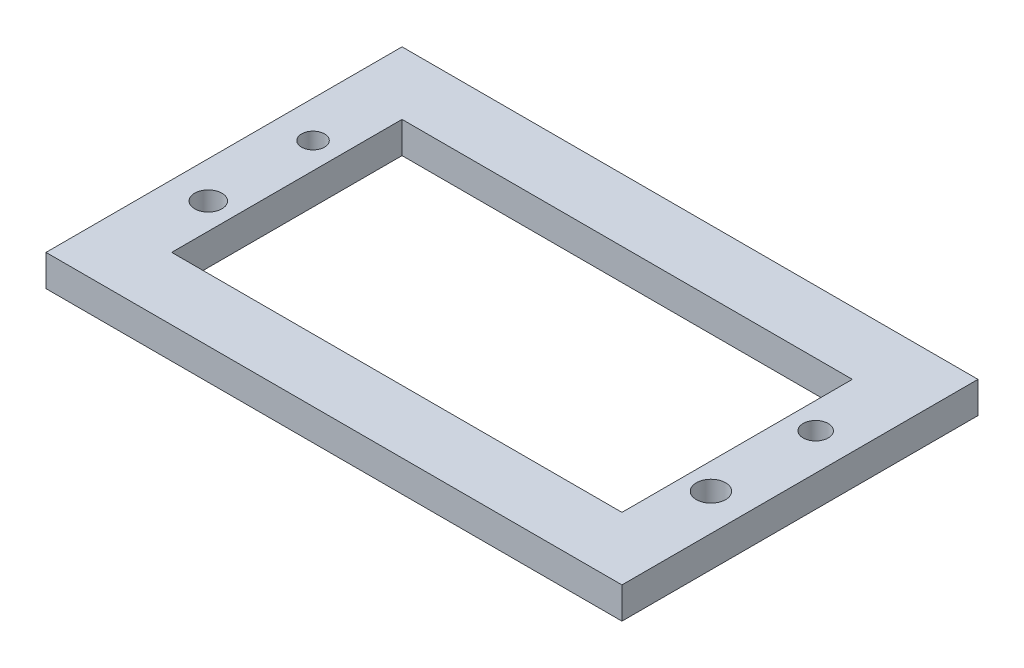
ISO-10303-21;
HEADER;
FILE_DESCRIPTION(('STEP AP214'),'2;1');
FILE_NAME('part.step','',(''),(''),'','','');
FILE_SCHEMA(('AUTOMOTIVE_DESIGN { 1 0 10303 214 1 1 1 1 }'));
ENDSEC;
DATA;
#1=APPLICATION_CONTEXT('core data for automotive mechanical design processes');
#2=APPLICATION_PROTOCOL_DEFINITION('international standard','automotive_design',2000,#1);
#3=PRODUCT_CONTEXT('',#1,'mechanical');
#4=PRODUCT('Part','Part','',(#3));
#5=PRODUCT_RELATED_PRODUCT_CATEGORY('part','',(#4));
#6=PRODUCT_DEFINITION_FORMATION('','',#4);
#7=PRODUCT_DEFINITION_CONTEXT('part definition',#1,'design');
#8=PRODUCT_DEFINITION('design','',#6,#7);
#9=PRODUCT_DEFINITION_SHAPE('','',#8);
#10=(LENGTH_UNIT() NAMED_UNIT(*) SI_UNIT(.MILLI.,.METRE.));
#11=(NAMED_UNIT(*) PLANE_ANGLE_UNIT() SI_UNIT($,.RADIAN.));
#12=(NAMED_UNIT(*) SI_UNIT($,.STERADIAN.) SOLID_ANGLE_UNIT());
#13=UNCERTAINTY_MEASURE_WITH_UNIT(LENGTH_MEASURE(1.E-05),#10,'distance_accuracy_value','');
#14=(GEOMETRIC_REPRESENTATION_CONTEXT(3) GLOBAL_UNCERTAINTY_ASSIGNED_CONTEXT((#13)) GLOBAL_UNIT_ASSIGNED_CONTEXT((#10,
#11,#12)) REPRESENTATION_CONTEXT('',''));
#15=CARTESIAN_POINT('',(0.,0.,0.));
#16=DIRECTION('',(0.,0.,1.));
#17=DIRECTION('',(1.,0.,0.));
#18=AXIS2_PLACEMENT_3D('',#15,#16,#17);
#19=CARTESIAN_POINT('',(0.,3.,0.));
#20=DIRECTION('',(0.,-1.,0.));
#21=DIRECTION('',(0.,0.,-1.));
#22=AXIS2_PLACEMENT_3D('',#19,#20,#21);
#23=PLANE('',#22);
#24=DIRECTION('',(0.,0.,-1.));
#25=VECTOR('',#24,1.);
#26=CARTESIAN_POINT('',(27.5,3.,17.));
#27=LINE('',#26,#25);
#28=CARTESIAN_POINT('',(27.5,3.,17.));
#29=VERTEX_POINT('',#28);
#30=CARTESIAN_POINT('',(27.5,3.,-17.));
#31=VERTEX_POINT('',#30);
#32=EDGE_CURVE('E137',#29,#31,#27,.T.);
#33=ORIENTED_EDGE('',*,*,#32,.T.);
#34=DIRECTION('',(-1.,0.,0.));
#35=VECTOR('',#34,1.);
#36=CARTESIAN_POINT('',(-27.5,3.,-17.));
#37=LINE('',#36,#35);
#38=CARTESIAN_POINT('',(-27.5,3.,-17.));
#39=VERTEX_POINT('',#38);
#40=EDGE_CURVE('E140',#31,#39,#37,.T.);
#41=ORIENTED_EDGE('',*,*,#40,.T.);
#42=DIRECTION('',(0.,0.,1.));
#43=VECTOR('',#42,1.);
#44=CARTESIAN_POINT('',(-27.5,3.,17.));
#45=LINE('',#44,#43);
#46=CARTESIAN_POINT('',(-27.5,3.,17.));
#47=VERTEX_POINT('',#46);
#48=EDGE_CURVE('E143',#39,#47,#45,.T.);
#49=ORIENTED_EDGE('',*,*,#48,.T.);
#50=DIRECTION('',(1.,0.,0.));
#51=VECTOR('',#50,1.);
#52=CARTESIAN_POINT('',(-27.5,3.,17.));
#53=LINE('',#52,#51);
#54=EDGE_CURVE('E145',#47,#29,#53,.T.);
#55=ORIENTED_EDGE('',*,*,#54,.T.);
#56=EDGE_LOOP('',(#33,#41,#49,#55));
#57=FACE_BOUND('',#56,.T.);
#58=DIRECTION('',(0.,0.,1.));
#59=VECTOR('',#58,1.);
#60=CARTESIAN_POINT('',(-21.5,3.,11.));
#61=LINE('',#60,#59);
#62=CARTESIAN_POINT('',(-21.5,3.,-11.));
#63=VERTEX_POINT('',#62);
#64=CARTESIAN_POINT('',(-21.5,3.,11.));
#65=VERTEX_POINT('',#64);
#66=EDGE_CURVE('E98',#63,#65,#61,.T.);
#67=ORIENTED_EDGE('',*,*,#66,.F.);
#68=DIRECTION('',(-1.,0.,0.));
#69=VECTOR('',#68,1.);
#70=CARTESIAN_POINT('',(-21.5,3.,-11.));
#71=LINE('',#70,#69);
#72=CARTESIAN_POINT('',(21.5,3.,-11.));
#73=VERTEX_POINT('',#72);
#74=EDGE_CURVE('E121',#73,#63,#71,.T.);
#75=ORIENTED_EDGE('',*,*,#74,.F.);
#76=DIRECTION('',(0.,0.,-1.));
#77=VECTOR('',#76,1.);
#78=CARTESIAN_POINT('',(21.5,3.,11.));
#79=LINE('',#78,#77);
#80=CARTESIAN_POINT('',(21.5,3.,11.));
#81=VERTEX_POINT('',#80);
#82=EDGE_CURVE('E119',#81,#73,#79,.T.);
#83=ORIENTED_EDGE('',*,*,#82,.F.);
#84=DIRECTION('',(1.,0.,0.));
#85=VECTOR('',#84,1.);
#86=CARTESIAN_POINT('',(-21.5,3.,11.));
#87=LINE('',#86,#85);
#88=EDGE_CURVE('E106',#65,#81,#87,.T.);
#89=ORIENTED_EDGE('',*,*,#88,.F.);
#90=EDGE_LOOP('',(#67,#75,#83,#89));
#91=FACE_BOUND('',#90,.T.);
#92=CARTESIAN_POINT('',(-24.,3.,-5.));
#93=DIRECTION('',(0.,1.,0.));
#94=DIRECTION('',(0.,0.,1.));
#95=AXIS2_PLACEMENT_3D('',#92,#93,#94);
#96=CIRCLE('',#95,1.1);
#97=CARTESIAN_POINT('',(-24.,3.,-3.9));
#98=VERTEX_POINT('',#97);
#99=EDGE_CURVE('E127',#98,#98,#96,.T.);
#100=ORIENTED_EDGE('',*,*,#99,.F.);
#101=EDGE_LOOP('',(#100));
#102=FACE_BOUND('',#101,.T.);
#103=CARTESIAN_POINT('',(-24.,3.,5.));
#104=DIRECTION('',(0.,1.,0.));
#105=DIRECTION('',(0.,0.,1.));
#106=AXIS2_PLACEMENT_3D('',#103,#104,#105);
#107=CIRCLE('',#106,1.3);
#108=CARTESIAN_POINT('',(-24.,3.,6.3));
#109=VERTEX_POINT('',#108);
#110=EDGE_CURVE('E249',#109,#109,#107,.T.);
#111=ORIENTED_EDGE('',*,*,#110,.F.);
#112=EDGE_LOOP('',(#111));
#113=FACE_BOUND('',#112,.T.);
#114=CARTESIAN_POINT('',(24.,3.,-5.));
#115=DIRECTION('',(0.,1.,0.));
#116=DIRECTION('',(0.,0.,1.));
#117=AXIS2_PLACEMENT_3D('',#114,#115,#116);
#118=CIRCLE('',#117,1.2);
#119=CARTESIAN_POINT('',(24.,3.,-3.8));
#120=VERTEX_POINT('',#119);
#121=EDGE_CURVE('E243',#120,#120,#118,.T.);
#122=ORIENTED_EDGE('',*,*,#121,.F.);
#123=EDGE_LOOP('',(#122));
#124=FACE_BOUND('',#123,.T.);
#125=CARTESIAN_POINT('',(24.,3.,5.));
#126=DIRECTION('',(0.,1.,0.));
#127=DIRECTION('',(0.,0.,1.));
#128=AXIS2_PLACEMENT_3D('',#125,#126,#127);
#129=CIRCLE('',#128,1.4);
#130=CARTESIAN_POINT('',(24.,3.,6.4));
#131=VERTEX_POINT('',#130);
#132=EDGE_CURVE('E234',#131,#131,#129,.T.);
#133=ORIENTED_EDGE('',*,*,#132,.F.);
#134=EDGE_LOOP('',(#133));
#135=FACE_BOUND('',#134,.T.);
#136=ADVANCED_FACE('F33',(#57,#91,#102,#113,#124,#135),#23,.F.);
#137=CARTESIAN_POINT('',(0.,0.,0.));
#138=DIRECTION('',(0.,-1.,0.));
#139=DIRECTION('',(0.,0.,-1.));
#140=AXIS2_PLACEMENT_3D('',#137,#138,#139);
#141=PLANE('',#140);
#142=CARTESIAN_POINT('',(24.,0.,-5.));
#143=DIRECTION('',(0.,1.,0.));
#144=DIRECTION('',(0.,0.,1.));
#145=AXIS2_PLACEMENT_3D('',#142,#143,#144);
#146=CIRCLE('',#145,1.2);
#147=CARTESIAN_POINT('',(24.,0.,-3.8));
#148=VERTEX_POINT('',#147);
#149=EDGE_CURVE('E240',#148,#148,#146,.T.);
#150=ORIENTED_EDGE('',*,*,#149,.T.);
#151=EDGE_LOOP('',(#150));
#152=FACE_BOUND('',#151,.T.);
#153=CARTESIAN_POINT('',(-24.,0.,-5.));
#154=DIRECTION('',(0.,1.,0.));
#155=DIRECTION('',(0.,0.,1.));
#156=AXIS2_PLACEMENT_3D('',#153,#154,#155);
#157=CIRCLE('',#156,1.1);
#158=CARTESIAN_POINT('',(-24.,0.,-3.9));
#159=VERTEX_POINT('',#158);
#160=EDGE_CURVE('E252',#159,#159,#157,.T.);
#161=ORIENTED_EDGE('',*,*,#160,.T.);
#162=EDGE_LOOP('',(#161));
#163=FACE_BOUND('',#162,.T.);
#164=DIRECTION('',(0.,0.,-1.));
#165=VECTOR('',#164,1.);
#166=CARTESIAN_POINT('',(27.5,0.,17.));
#167=LINE('',#166,#165);
#168=CARTESIAN_POINT('',(27.5,0.,17.));
#169=VERTEX_POINT('',#168);
#170=CARTESIAN_POINT('',(27.5,0.,-17.));
#171=VERTEX_POINT('',#170);
#172=EDGE_CURVE('E114',#169,#171,#167,.T.);
#173=ORIENTED_EDGE('',*,*,#172,.F.);
#174=DIRECTION('',(1.,0.,0.));
#175=VECTOR('',#174,1.);
#176=CARTESIAN_POINT('',(-27.5,0.,17.));
#177=LINE('',#176,#175);
#178=CARTESIAN_POINT('',(-27.5,0.,17.));
#179=VERTEX_POINT('',#178);
#180=EDGE_CURVE('E141',#179,#169,#177,.T.);
#181=ORIENTED_EDGE('',*,*,#180,.F.);
#182=DIRECTION('',(0.,0.,1.));
#183=VECTOR('',#182,1.);
#184=CARTESIAN_POINT('',(-27.5,0.,17.));
#185=LINE('',#184,#183);
#186=CARTESIAN_POINT('',(-27.5,0.,-17.));
#187=VERTEX_POINT('',#186);
#188=EDGE_CURVE('E152',#187,#179,#185,.T.);
#189=ORIENTED_EDGE('',*,*,#188,.F.);
#190=DIRECTION('',(-1.,0.,0.));
#191=VECTOR('',#190,1.);
#192=CARTESIAN_POINT('',(-27.5,0.,-17.));
#193=LINE('',#192,#191);
#194=EDGE_CURVE('E150',#171,#187,#193,.T.);
#195=ORIENTED_EDGE('',*,*,#194,.F.);
#196=EDGE_LOOP('',(#173,#181,#189,#195));
#197=FACE_BOUND('',#196,.T.);
#198=DIRECTION('',(-1.,0.,0.));
#199=VECTOR('',#198,1.);
#200=CARTESIAN_POINT('',(-21.5,0.,-11.));
#201=LINE('',#200,#199);
#202=CARTESIAN_POINT('',(21.5,0.,-11.));
#203=VERTEX_POINT('',#202);
#204=CARTESIAN_POINT('',(-21.5,0.,-11.));
#205=VERTEX_POINT('',#204);
#206=EDGE_CURVE('E107',#203,#205,#201,.T.);
#207=ORIENTED_EDGE('',*,*,#206,.T.);
#208=DIRECTION('',(0.,0.,1.));
#209=VECTOR('',#208,1.);
#210=CARTESIAN_POINT('',(-21.5,0.,11.));
#211=LINE('',#210,#209);
#212=CARTESIAN_POINT('',(-21.5,0.,11.));
#213=VERTEX_POINT('',#212);
#214=EDGE_CURVE('E56',#205,#213,#211,.T.);
#215=ORIENTED_EDGE('',*,*,#214,.T.);
#216=DIRECTION('',(1.,0.,0.));
#217=VECTOR('',#216,1.);
#218=CARTESIAN_POINT('',(-21.5,0.,11.));
#219=LINE('',#218,#217);
#220=CARTESIAN_POINT('',(21.5,0.,11.));
#221=VERTEX_POINT('',#220);
#222=EDGE_CURVE('E113',#213,#221,#219,.T.);
#223=ORIENTED_EDGE('',*,*,#222,.T.);
#224=DIRECTION('',(0.,0.,-1.));
#225=VECTOR('',#224,1.);
#226=CARTESIAN_POINT('',(21.5,0.,11.));
#227=LINE('',#226,#225);
#228=EDGE_CURVE('E129',#221,#203,#227,.T.);
#229=ORIENTED_EDGE('',*,*,#228,.T.);
#230=EDGE_LOOP('',(#207,#215,#223,#229));
#231=FACE_BOUND('',#230,.T.);
#232=CARTESIAN_POINT('',(-24.,0.,5.));
#233=DIRECTION('',(0.,1.,0.));
#234=DIRECTION('',(0.,0.,1.));
#235=AXIS2_PLACEMENT_3D('',#232,#233,#234);
#236=CIRCLE('',#235,1.3);
#237=CARTESIAN_POINT('',(-24.,0.,6.3));
#238=VERTEX_POINT('',#237);
#239=EDGE_CURVE('E246',#238,#238,#236,.T.);
#240=ORIENTED_EDGE('',*,*,#239,.T.);
#241=EDGE_LOOP('',(#240));
#242=FACE_BOUND('',#241,.T.);
#243=CARTESIAN_POINT('',(24.,0.,5.));
#244=DIRECTION('',(0.,1.,0.));
#245=DIRECTION('',(0.,0.,1.));
#246=AXIS2_PLACEMENT_3D('',#243,#244,#245);
#247=CIRCLE('',#246,1.4);
#248=CARTESIAN_POINT('',(24.,0.,6.4));
#249=VERTEX_POINT('',#248);
#250=EDGE_CURVE('E237',#249,#249,#247,.T.);
#251=ORIENTED_EDGE('',*,*,#250,.T.);
#252=EDGE_LOOP('',(#251));
#253=FACE_BOUND('',#252,.T.);
#254=ADVANCED_FACE('F170',(#152,#163,#197,#231,#242,#253),#141,.T.);
#255=CARTESIAN_POINT('',(27.5,3.,17.));
#256=DIRECTION('',(-1.,0.,0.));
#257=DIRECTION('',(0.,0.,1.));
#258=AXIS2_PLACEMENT_3D('',#255,#256,#257);
#259=PLANE('',#258);
#260=ORIENTED_EDGE('',*,*,#172,.T.);
#261=DIRECTION('',(0.,-1.,0.));
#262=VECTOR('',#261,1.);
#263=CARTESIAN_POINT('',(27.5,3.,-17.));
#264=LINE('',#263,#262);
#265=EDGE_CURVE('E11',#31,#171,#264,.T.);
#266=ORIENTED_EDGE('',*,*,#265,.F.);
#267=ORIENTED_EDGE('',*,*,#32,.F.);
#268=DIRECTION('',(0.,-1.,0.));
#269=VECTOR('',#268,1.);
#270=CARTESIAN_POINT('',(27.5,3.,17.));
#271=LINE('',#270,#269);
#272=EDGE_CURVE('E147',#29,#169,#271,.T.);
#273=ORIENTED_EDGE('',*,*,#272,.T.);
#274=EDGE_LOOP('',(#260,#266,#267,#273));
#275=FACE_BOUND('',#274,.T.);
#276=ADVANCED_FACE('F35',(#275),#259,.F.);
#277=CARTESIAN_POINT('',(-27.5,3.,-17.));
#278=DIRECTION('',(0.,0.,1.));
#279=DIRECTION('',(1.,0.,0.));
#280=AXIS2_PLACEMENT_3D('',#277,#278,#279);
#281=PLANE('',#280);
#282=ORIENTED_EDGE('',*,*,#194,.T.);
#283=DIRECTION('',(0.,-1.,0.));
#284=VECTOR('',#283,1.);
#285=CARTESIAN_POINT('',(-27.5,3.,-17.));
#286=LINE('',#285,#284);
#287=EDGE_CURVE('E41',#39,#187,#286,.T.);
#288=ORIENTED_EDGE('',*,*,#287,.F.);
#289=ORIENTED_EDGE('',*,*,#40,.F.);
#290=ORIENTED_EDGE('',*,*,#265,.T.);
#291=EDGE_LOOP('',(#282,#288,#289,#290));
#292=FACE_BOUND('',#291,.T.);
#293=ADVANCED_FACE('F180',(#292),#281,.F.);
#294=CARTESIAN_POINT('',(-27.5,3.,17.));
#295=DIRECTION('',(1.,0.,0.));
#296=DIRECTION('',(0.,0.,-1.));
#297=AXIS2_PLACEMENT_3D('',#294,#295,#296);
#298=PLANE('',#297);
#299=ORIENTED_EDGE('',*,*,#188,.T.);
#300=DIRECTION('',(0.,-1.,0.));
#301=VECTOR('',#300,1.);
#302=CARTESIAN_POINT('',(-27.5,3.,17.));
#303=LINE('',#302,#301);
#304=EDGE_CURVE('E157',#47,#179,#303,.T.);
#305=ORIENTED_EDGE('',*,*,#304,.F.);
#306=ORIENTED_EDGE('',*,*,#48,.F.);
#307=ORIENTED_EDGE('',*,*,#287,.T.);
#308=EDGE_LOOP('',(#299,#305,#306,#307));
#309=FACE_BOUND('',#308,.T.);
#310=ADVANCED_FACE('F164',(#309),#298,.F.);
#311=CARTESIAN_POINT('',(-27.5,3.,17.));
#312=DIRECTION('',(0.,0.,-1.));
#313=DIRECTION('',(-1.,0.,0.));
#314=AXIS2_PLACEMENT_3D('',#311,#312,#313);
#315=PLANE('',#314);
#316=ORIENTED_EDGE('',*,*,#180,.T.);
#317=ORIENTED_EDGE('',*,*,#272,.F.);
#318=ORIENTED_EDGE('',*,*,#54,.F.);
#319=ORIENTED_EDGE('',*,*,#304,.T.);
#320=EDGE_LOOP('',(#316,#317,#318,#319));
#321=FACE_BOUND('',#320,.T.);
#322=ADVANCED_FACE('F174',(#321),#315,.F.);
#323=CARTESIAN_POINT('',(-21.5,3.,11.));
#324=DIRECTION('',(1.,0.,0.));
#325=DIRECTION('',(0.,0.,-1.));
#326=AXIS2_PLACEMENT_3D('',#323,#324,#325);
#327=PLANE('',#326);
#328=ORIENTED_EDGE('',*,*,#214,.F.);
#329=DIRECTION('',(0.,-1.,0.));
#330=VECTOR('',#329,1.);
#331=CARTESIAN_POINT('',(-21.5,3.,-11.));
#332=LINE('',#331,#330);
#333=EDGE_CURVE('E102',#63,#205,#332,.T.);
#334=ORIENTED_EDGE('',*,*,#333,.F.);
#335=ORIENTED_EDGE('',*,*,#66,.T.);
#336=DIRECTION('',(0.,-1.,0.));
#337=VECTOR('',#336,1.);
#338=CARTESIAN_POINT('',(-21.5,3.,11.));
#339=LINE('',#338,#337);
#340=EDGE_CURVE('E101',#65,#213,#339,.T.);
#341=ORIENTED_EDGE('',*,*,#340,.T.);
#342=EDGE_LOOP('',(#328,#334,#335,#341));
#343=FACE_BOUND('',#342,.T.);
#344=ADVANCED_FACE('F100',(#343),#327,.T.);
#345=CARTESIAN_POINT('',(-21.5,3.,11.));
#346=DIRECTION('',(0.,0.,-1.));
#347=DIRECTION('',(-1.,0.,0.));
#348=AXIS2_PLACEMENT_3D('',#345,#346,#347);
#349=PLANE('',#348);
#350=ORIENTED_EDGE('',*,*,#222,.F.);
#351=ORIENTED_EDGE('',*,*,#340,.F.);
#352=ORIENTED_EDGE('',*,*,#88,.T.);
#353=DIRECTION('',(0.,-1.,0.));
#354=VECTOR('',#353,1.);
#355=CARTESIAN_POINT('',(21.5,3.,11.));
#356=LINE('',#355,#354);
#357=EDGE_CURVE('E115',#81,#221,#356,.T.);
#358=ORIENTED_EDGE('',*,*,#357,.T.);
#359=EDGE_LOOP('',(#350,#351,#352,#358));
#360=FACE_BOUND('',#359,.T.);
#361=ADVANCED_FACE('F110',(#360),#349,.T.);
#362=CARTESIAN_POINT('',(21.5,3.,11.));
#363=DIRECTION('',(-1.,0.,0.));
#364=DIRECTION('',(0.,0.,1.));
#365=AXIS2_PLACEMENT_3D('',#362,#363,#364);
#366=PLANE('',#365);
#367=ORIENTED_EDGE('',*,*,#228,.F.);
#368=ORIENTED_EDGE('',*,*,#357,.F.);
#369=ORIENTED_EDGE('',*,*,#82,.T.);
#370=DIRECTION('',(0.,-1.,0.));
#371=VECTOR('',#370,1.);
#372=CARTESIAN_POINT('',(21.5,3.,-11.));
#373=LINE('',#372,#371);
#374=EDGE_CURVE('E48',#73,#203,#373,.T.);
#375=ORIENTED_EDGE('',*,*,#374,.T.);
#376=EDGE_LOOP('',(#367,#368,#369,#375));
#377=FACE_BOUND('',#376,.T.);
#378=ADVANCED_FACE('F204',(#377),#366,.T.);
#379=CARTESIAN_POINT('',(-21.5,3.,-11.));
#380=DIRECTION('',(0.,0.,1.));
#381=DIRECTION('',(1.,0.,0.));
#382=AXIS2_PLACEMENT_3D('',#379,#380,#381);
#383=PLANE('',#382);
#384=ORIENTED_EDGE('',*,*,#206,.F.);
#385=ORIENTED_EDGE('',*,*,#374,.F.);
#386=ORIENTED_EDGE('',*,*,#74,.T.);
#387=ORIENTED_EDGE('',*,*,#333,.T.);
#388=EDGE_LOOP('',(#384,#385,#386,#387));
#389=FACE_BOUND('',#388,.T.);
#390=ADVANCED_FACE('F208',(#389),#383,.T.);
#391=CARTESIAN_POINT('',(-24.,3.,-5.));
#392=DIRECTION('',(0.,-1.,0.));
#393=DIRECTION('',(0.,0.,-1.));
#394=AXIS2_PLACEMENT_3D('',#391,#392,#393);
#395=CYLINDRICAL_SURFACE('',#394,1.1);
#396=ORIENTED_EDGE('',*,*,#99,.T.);
#397=EDGE_LOOP('',(#396));
#398=FACE_BOUND('',#397,.T.);
#399=ORIENTED_EDGE('',*,*,#160,.F.);
#400=EDGE_LOOP('',(#399));
#401=FACE_BOUND('',#400,.T.);
#402=ADVANCED_FACE('F214',(#398,#401),#395,.F.);
#403=CARTESIAN_POINT('',(-24.,3.,5.));
#404=DIRECTION('',(0.,-1.,0.));
#405=DIRECTION('',(0.,0.,-1.));
#406=AXIS2_PLACEMENT_3D('',#403,#404,#405);
#407=CYLINDRICAL_SURFACE('',#406,1.3);
#408=ORIENTED_EDGE('',*,*,#110,.T.);
#409=EDGE_LOOP('',(#408));
#410=FACE_BOUND('',#409,.T.);
#411=ORIENTED_EDGE('',*,*,#239,.F.);
#412=EDGE_LOOP('',(#411));
#413=FACE_BOUND('',#412,.T.);
#414=ADVANCED_FACE('F217',(#410,#413),#407,.F.);
#415=CARTESIAN_POINT('',(24.,3.,-5.));
#416=DIRECTION('',(0.,-1.,0.));
#417=DIRECTION('',(0.,0.,-1.));
#418=AXIS2_PLACEMENT_3D('',#415,#416,#417);
#419=CYLINDRICAL_SURFACE('',#418,1.2);
#420=ORIENTED_EDGE('',*,*,#121,.T.);
#421=EDGE_LOOP('',(#420));
#422=FACE_BOUND('',#421,.T.);
#423=ORIENTED_EDGE('',*,*,#149,.F.);
#424=EDGE_LOOP('',(#423));
#425=FACE_BOUND('',#424,.T.);
#426=ADVANCED_FACE('F221',(#422,#425),#419,.F.);
#427=CARTESIAN_POINT('',(24.,3.,5.));
#428=DIRECTION('',(0.,-1.,0.));
#429=DIRECTION('',(0.,0.,-1.));
#430=AXIS2_PLACEMENT_3D('',#427,#428,#429);
#431=CYLINDRICAL_SURFACE('',#430,1.4);
#432=ORIENTED_EDGE('',*,*,#132,.T.);
#433=EDGE_LOOP('',(#432));
#434=FACE_BOUND('',#433,.T.);
#435=ORIENTED_EDGE('',*,*,#250,.F.);
#436=EDGE_LOOP('',(#435));
#437=FACE_BOUND('',#436,.T.);
#438=ADVANCED_FACE('F225',(#434,#437),#431,.F.);
#439=CLOSED_SHELL('',(#136,#254,#276,#293,#310,#322,#344,#361,#378,#390,#402,#414,#426,#438));
#440=MANIFOLD_SOLID_BREP('B2',#439);
#441=ADVANCED_BREP_SHAPE_REPRESENTATION('',(#18,#440),#14);
#442=SHAPE_DEFINITION_REPRESENTATION(#9,#441);
ENDSEC;
END-ISO-10303-21;
